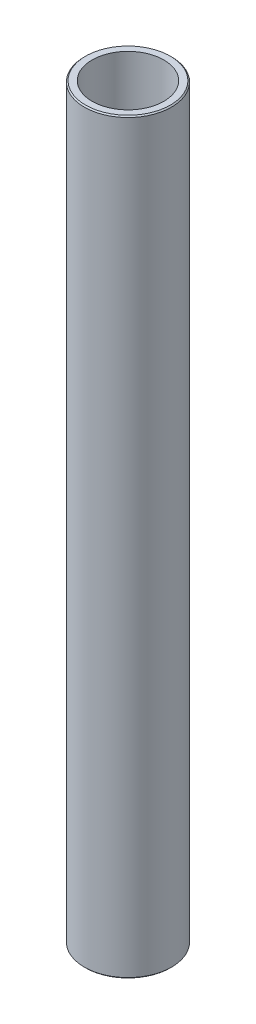
ISO-10303-21;
HEADER;
FILE_DESCRIPTION(('STEP AP214'),'2;1');
FILE_NAME('part.step','',(''),(''),'','','');
FILE_SCHEMA(('AUTOMOTIVE_DESIGN { 1 0 10303 214 1 1 1 1 }'));
ENDSEC;
DATA;
#1=APPLICATION_CONTEXT('core data for automotive mechanical design processes');
#2=APPLICATION_PROTOCOL_DEFINITION('international standard','automotive_design',2000,#1);
#3=PRODUCT_CONTEXT('',#1,'mechanical');
#4=PRODUCT('Part','Part','',(#3));
#5=PRODUCT_RELATED_PRODUCT_CATEGORY('part','',(#4));
#6=PRODUCT_DEFINITION_FORMATION('','',#4);
#7=PRODUCT_DEFINITION_CONTEXT('part definition',#1,'design');
#8=PRODUCT_DEFINITION('design','',#6,#7);
#9=PRODUCT_DEFINITION_SHAPE('','',#8);
#10=(LENGTH_UNIT() NAMED_UNIT(*) SI_UNIT(.MILLI.,.METRE.));
#11=(NAMED_UNIT(*) PLANE_ANGLE_UNIT() SI_UNIT($,.RADIAN.));
#12=(NAMED_UNIT(*) SI_UNIT($,.STERADIAN.) SOLID_ANGLE_UNIT());
#13=UNCERTAINTY_MEASURE_WITH_UNIT(LENGTH_MEASURE(1.E-05),#10,'distance_accuracy_value','');
#14=(GEOMETRIC_REPRESENTATION_CONTEXT(3) GLOBAL_UNCERTAINTY_ASSIGNED_CONTEXT((#13)) GLOBAL_UNIT_ASSIGNED_CONTEXT((#10,
#11,#12)) REPRESENTATION_CONTEXT('',''));
#15=CARTESIAN_POINT('',(0.,0.,0.));
#16=DIRECTION('',(0.,0.,1.));
#17=DIRECTION('',(1.,0.,0.));
#18=AXIS2_PLACEMENT_3D('',#15,#16,#17);
#19=CARTESIAN_POINT('',(0.,600.,0.));
#20=DIRECTION('',(0.,-1.,0.));
#21=DIRECTION('',(0.,0.,-1.));
#22=AXIS2_PLACEMENT_3D('',#19,#20,#21);
#23=CYLINDRICAL_SURFACE('',#22,35.);
#24=CARTESIAN_POINT('',(0.,599.046392756338,0.));
#25=DIRECTION('',(0.,1.,0.));
#26=DIRECTION('',(0.,0.,1.));
#27=AXIS2_PLACEMENT_3D('',#24,#25,#26);
#28=CIRCLE('',#27,35.);
#29=CARTESIAN_POINT('',(0.,599.046392756338,35.));
#30=VERTEX_POINT('',#29);
#31=EDGE_CURVE('E50',#30,#30,#28,.F.);
#32=ORIENTED_EDGE('',*,*,#31,.T.);
#33=EDGE_LOOP('',(#32));
#34=FACE_BOUND('',#33,.T.);
#35=CARTESIAN_POINT('',(0.,0.953607243661447,0.));
#36=DIRECTION('',(0.,1.,0.));
#37=DIRECTION('',(0.,0.,1.));
#38=AXIS2_PLACEMENT_3D('',#35,#36,#37);
#39=CIRCLE('',#38,35.);
#40=CARTESIAN_POINT('',(0.,0.953607243661447,35.));
#41=VERTEX_POINT('',#40);
#42=EDGE_CURVE('E51',#41,#41,#39,.T.);
#43=ORIENTED_EDGE('',*,*,#42,.T.);
#44=EDGE_LOOP('',(#43));
#45=FACE_BOUND('',#44,.T.);
#46=ADVANCED_FACE('F39',(#34,#45),#23,.T.);
#47=CARTESIAN_POINT('',(0.,600.,0.));
#48=DIRECTION('',(0.,1.,0.));
#49=DIRECTION('',(0.,0.,1.));
#50=AXIS2_PLACEMENT_3D('',#47,#48,#49);
#51=PLANE('',#50);
#52=CARTESIAN_POINT('',(0.,600.,0.));
#53=DIRECTION('',(0.,1.,0.));
#54=DIRECTION('',(0.,0.,1.));
#55=AXIS2_PLACEMENT_3D('',#52,#53,#54);
#56=CIRCLE('',#55,34.0463927563384);
#57=CARTESIAN_POINT('',(0.,600.,34.0463927563384));
#58=VERTEX_POINT('',#57);
#59=EDGE_CURVE('E54',#58,#58,#56,.T.);
#60=ORIENTED_EDGE('',*,*,#59,.T.);
#61=EDGE_LOOP('',(#60));
#62=FACE_BOUND('',#61,.T.);
#63=CARTESIAN_POINT('',(0.,600.,0.));
#64=DIRECTION('',(0.,1.,0.));
#65=DIRECTION('',(0.,0.,1.));
#66=AXIS2_PLACEMENT_3D('',#63,#64,#65);
#67=CIRCLE('',#66,28.8109159595596);
#68=CARTESIAN_POINT('',(0.,600.,28.8109159595596));
#69=VERTEX_POINT('',#68);
#70=EDGE_CURVE('E58',#69,#69,#67,.T.);
#71=ORIENTED_EDGE('',*,*,#70,.F.);
#72=EDGE_LOOP('',(#71));
#73=FACE_BOUND('',#72,.T.);
#74=ADVANCED_FACE('F69',(#62,#73),#51,.T.);
#75=CARTESIAN_POINT('',(0.,0.,0.));
#76=DIRECTION('',(0.,1.,0.));
#77=DIRECTION('',(0.,0.,1.));
#78=AXIS2_PLACEMENT_3D('',#75,#76,#77);
#79=PLANE('',#78);
#80=CARTESIAN_POINT('',(0.,0.,0.));
#81=DIRECTION('',(0.,1.,0.));
#82=DIRECTION('',(0.,0.,1.));
#83=AXIS2_PLACEMENT_3D('',#80,#81,#82);
#84=CIRCLE('',#83,34.0463927563385);
#85=CARTESIAN_POINT('',(0.,0.,34.0463927563385));
#86=VERTEX_POINT('',#85);
#87=EDGE_CURVE('E10',#86,#86,#84,.F.);
#88=ORIENTED_EDGE('',*,*,#87,.T.);
#89=EDGE_LOOP('',(#88));
#90=FACE_BOUND('',#89,.T.);
#91=CARTESIAN_POINT('',(0.,0.,0.));
#92=DIRECTION('',(0.,1.,0.));
#93=DIRECTION('',(0.,0.,1.));
#94=AXIS2_PLACEMENT_3D('',#91,#92,#93);
#95=CIRCLE('',#94,28.8109159595596);
#96=CARTESIAN_POINT('',(0.,0.,28.8109159595596));
#97=VERTEX_POINT('',#96);
#98=EDGE_CURVE('E63',#97,#97,#95,.T.);
#99=ORIENTED_EDGE('',*,*,#98,.T.);
#100=EDGE_LOOP('',(#99));
#101=FACE_BOUND('',#100,.T.);
#102=ADVANCED_FACE('F75',(#90,#101),#79,.F.);
#103=CARTESIAN_POINT('',(0.,600.,0.));
#104=DIRECTION('',(0.,-1.,0.));
#105=DIRECTION('',(0.,0.,-1.));
#106=AXIS2_PLACEMENT_3D('',#103,#104,#105);
#107=CYLINDRICAL_SURFACE('',#106,28.8109159595596);
#108=ORIENTED_EDGE('',*,*,#70,.T.);
#109=EDGE_LOOP('',(#108));
#110=FACE_BOUND('',#109,.T.);
#111=ORIENTED_EDGE('',*,*,#98,.F.);
#112=EDGE_LOOP('',(#111));
#113=FACE_BOUND('',#112,.T.);
#114=ADVANCED_FACE('F70',(#110,#113),#107,.F.);
#115=CARTESIAN_POINT('',(0.,600.,0.));
#116=DIRECTION('',(0.,-1.,0.));
#117=DIRECTION('',(0.,0.,-1.));
#118=AXIS2_PLACEMENT_3D('',#115,#116,#117);
#119=CONICAL_SURFACE('',#118,34.0463927563384,0.785398163397466);
#120=ORIENTED_EDGE('',*,*,#31,.F.);
#121=EDGE_LOOP('',(#120));
#122=FACE_BOUND('',#121,.T.);
#123=ORIENTED_EDGE('',*,*,#59,.F.);
#124=EDGE_LOOP('',(#123));
#125=FACE_BOUND('',#124,.T.);
#126=ADVANCED_FACE('F81',(#122,#125),#119,.T.);
#127=CARTESIAN_POINT('',(0.,0.953607243661447,0.));
#128=DIRECTION('',(0.,1.,0.));
#129=DIRECTION('',(0.,0.,1.));
#130=AXIS2_PLACEMENT_3D('',#127,#128,#129);
#131=CONICAL_SURFACE('',#130,35.,0.785398163397466);
#132=ORIENTED_EDGE('',*,*,#87,.F.);
#133=EDGE_LOOP('',(#132));
#134=FACE_BOUND('',#133,.T.);
#135=ORIENTED_EDGE('',*,*,#42,.F.);
#136=EDGE_LOOP('',(#135));
#137=FACE_BOUND('',#136,.T.);
#138=ADVANCED_FACE('F45',(#134,#137),#131,.T.);
#139=CLOSED_SHELL('',(#46,#74,#102,#114,#126,#138));
#140=MANIFOLD_SOLID_BREP('B2',#139);
#141=ADVANCED_BREP_SHAPE_REPRESENTATION('',(#18,#140),#14);
#142=SHAPE_DEFINITION_REPRESENTATION(#9,#141);
ENDSEC;
END-ISO-10303-21;
